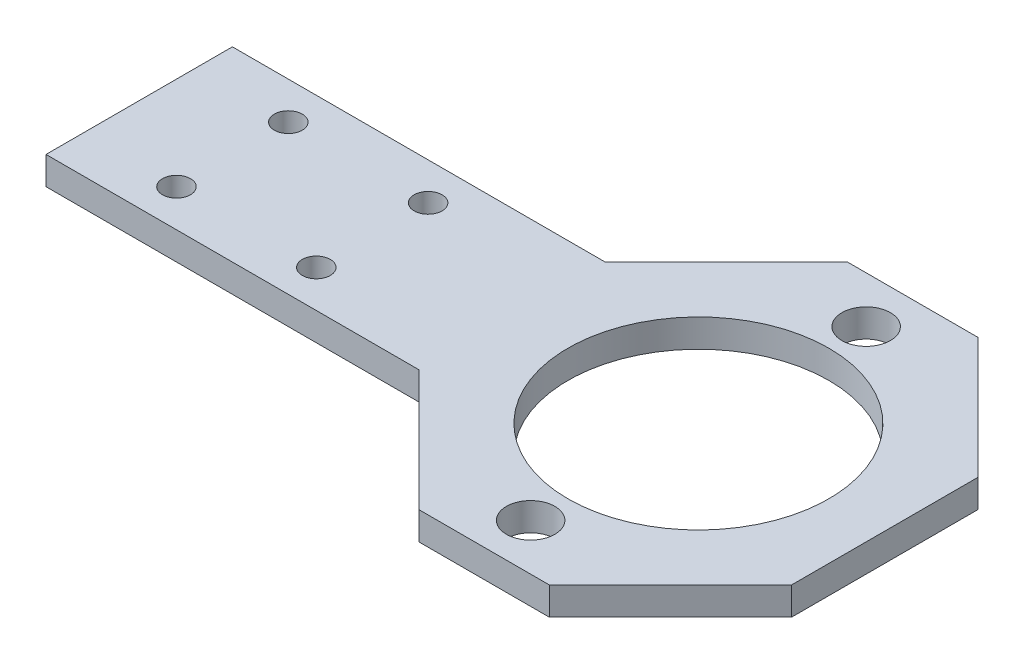
ISO-10303-21;
HEADER;
FILE_DESCRIPTION(('STEP AP214'),'2;1');
FILE_NAME('part.step','',(''),(''),'','','');
FILE_SCHEMA(('AUTOMOTIVE_DESIGN { 1 0 10303 214 1 1 1 1 }'));
ENDSEC;
DATA;
#1=APPLICATION_CONTEXT('core data for automotive mechanical design processes');
#2=APPLICATION_PROTOCOL_DEFINITION('international standard','automotive_design',2000,#1);
#3=PRODUCT_CONTEXT('',#1,'mechanical');
#4=PRODUCT('Part','Part','',(#3));
#5=PRODUCT_RELATED_PRODUCT_CATEGORY('part','',(#4));
#6=PRODUCT_DEFINITION_FORMATION('','',#4);
#7=PRODUCT_DEFINITION_CONTEXT('part definition',#1,'design');
#8=PRODUCT_DEFINITION('design','',#6,#7);
#9=PRODUCT_DEFINITION_SHAPE('','',#8);
#10=(LENGTH_UNIT() NAMED_UNIT(*) SI_UNIT(.MILLI.,.METRE.));
#11=(NAMED_UNIT(*) PLANE_ANGLE_UNIT() SI_UNIT($,.RADIAN.));
#12=(NAMED_UNIT(*) SI_UNIT($,.STERADIAN.) SOLID_ANGLE_UNIT());
#13=UNCERTAINTY_MEASURE_WITH_UNIT(LENGTH_MEASURE(1.E-05),#10,'distance_accuracy_value','');
#14=(GEOMETRIC_REPRESENTATION_CONTEXT(3) GLOBAL_UNCERTAINTY_ASSIGNED_CONTEXT((#13)) GLOBAL_UNIT_ASSIGNED_CONTEXT((#10,
#11,#12)) REPRESENTATION_CONTEXT('',''));
#15=CARTESIAN_POINT('',(0.,0.,0.));
#16=DIRECTION('',(0.,0.,1.));
#17=DIRECTION('',(1.,0.,0.));
#18=AXIS2_PLACEMENT_3D('',#15,#16,#17);
#19=CARTESIAN_POINT('',(-14.9999999999999,3.,15.));
#20=DIRECTION('',(-0.707106781186545,0.,0.70710678118655));
#21=DIRECTION('',(0.70710678118655,0.,0.707106781186545));
#22=AXIS2_PLACEMENT_3D('',#19,#20,#21);
#23=PLANE('',#22);
#24=DIRECTION('',(-0.70710678118655,0.,-0.707106781186545));
#25=VECTOR('',#24,1.);
#26=CARTESIAN_POINT('',(-14.9999999999999,0.,15.));
#27=LINE('',#26,#25);
#28=CARTESIAN_POINT('',(-6.99999999999997,0.,23.));
#29=VERTEX_POINT('',#28);
#30=CARTESIAN_POINT('',(-20.,0.,10.));
#31=VERTEX_POINT('',#30);
#32=EDGE_CURVE('E185',#29,#31,#27,.T.);
#33=ORIENTED_EDGE('',*,*,#32,.F.);
#34=DIRECTION('',(0.,-1.,0.));
#35=VECTOR('',#34,1.);
#36=CARTESIAN_POINT('',(-6.99999999999997,3.,23.));
#37=LINE('',#36,#35);
#38=CARTESIAN_POINT('',(-6.99999999999997,3.,23.));
#39=VERTEX_POINT('',#38);
#40=EDGE_CURVE('E11',#39,#29,#37,.T.);
#41=ORIENTED_EDGE('',*,*,#40,.F.);
#42=DIRECTION('',(-0.70710678118655,0.,-0.707106781186545));
#43=VECTOR('',#42,1.);
#44=CARTESIAN_POINT('',(-14.9999999999999,3.,15.));
#45=LINE('',#44,#43);
#46=CARTESIAN_POINT('',(-20.,3.,10.));
#47=VERTEX_POINT('',#46);
#48=EDGE_CURVE('E266',#39,#47,#45,.T.);
#49=ORIENTED_EDGE('',*,*,#48,.T.);
#50=DIRECTION('',(0.,-1.,0.));
#51=VECTOR('',#50,1.);
#52=CARTESIAN_POINT('',(-20.,3.,10.));
#53=LINE('',#52,#51);
#54=EDGE_CURVE('E100',#47,#31,#53,.T.);
#55=ORIENTED_EDGE('',*,*,#54,.T.);
#56=EDGE_LOOP('',(#33,#41,#49,#55));
#57=FACE_BOUND('',#56,.T.);
#58=ADVANCED_FACE('F41',(#57),#23,.T.);
#59=CARTESIAN_POINT('',(0.,3.,23.));
#60=DIRECTION('',(0.,0.,1.));
#61=DIRECTION('',(1.,0.,0.));
#62=AXIS2_PLACEMENT_3D('',#59,#60,#61);
#63=PLANE('',#62);
#64=DIRECTION('',(-1.,0.,0.));
#65=VECTOR('',#64,1.);
#66=CARTESIAN_POINT('',(0.,0.,23.));
#67=LINE('',#66,#65);
#68=CARTESIAN_POINT('',(6.99999999999994,0.,23.));
#69=VERTEX_POINT('',#68);
#70=EDGE_CURVE('E188',#69,#29,#67,.T.);
#71=ORIENTED_EDGE('',*,*,#70,.F.);
#72=DIRECTION('',(0.,-1.,0.));
#73=VECTOR('',#72,1.);
#74=CARTESIAN_POINT('',(6.99999999999994,3.,23.));
#75=LINE('',#74,#73);
#76=CARTESIAN_POINT('',(6.99999999999994,3.,23.));
#77=VERTEX_POINT('',#76);
#78=EDGE_CURVE('E51',#77,#69,#75,.T.);
#79=ORIENTED_EDGE('',*,*,#78,.F.);
#80=DIRECTION('',(-1.,0.,0.));
#81=VECTOR('',#80,1.);
#82=CARTESIAN_POINT('',(0.,3.,23.));
#83=LINE('',#82,#81);
#84=EDGE_CURVE('E259',#77,#39,#83,.T.);
#85=ORIENTED_EDGE('',*,*,#84,.T.);
#86=ORIENTED_EDGE('',*,*,#40,.T.);
#87=EDGE_LOOP('',(#71,#79,#85,#86));
#88=FACE_BOUND('',#87,.T.);
#89=ADVANCED_FACE('F248',(#88),#63,.T.);
#90=CARTESIAN_POINT('',(14.9999999999999,3.,15.0000000000001));
#91=DIRECTION('',(0.707106781186544,0.,0.707106781186551));
#92=DIRECTION('',(0.707106781186551,0.,-0.707106781186544));
#93=AXIS2_PLACEMENT_3D('',#90,#91,#92);
#94=PLANE('',#93);
#95=DIRECTION('',(-0.707106781186551,0.,0.707106781186544));
#96=VECTOR('',#95,1.);
#97=CARTESIAN_POINT('',(14.9999999999999,0.,15.0000000000001));
#98=LINE('',#97,#96);
#99=CARTESIAN_POINT('',(20.,0.,10.));
#100=VERTEX_POINT('',#99);
#101=EDGE_CURVE('E192',#100,#69,#98,.T.);
#102=ORIENTED_EDGE('',*,*,#101,.F.);
#103=DIRECTION('',(0.,-1.,0.));
#104=VECTOR('',#103,1.);
#105=CARTESIAN_POINT('',(20.,3.,10.));
#106=LINE('',#105,#104);
#107=CARTESIAN_POINT('',(20.,3.,10.));
#108=VERTEX_POINT('',#107);
#109=EDGE_CURVE('E235',#108,#100,#106,.T.);
#110=ORIENTED_EDGE('',*,*,#109,.F.);
#111=DIRECTION('',(-0.707106781186551,0.,0.707106781186544));
#112=VECTOR('',#111,1.);
#113=CARTESIAN_POINT('',(14.9999999999999,3.,15.0000000000001));
#114=LINE('',#113,#112);
#115=EDGE_CURVE('E244',#108,#77,#114,.T.);
#116=ORIENTED_EDGE('',*,*,#115,.T.);
#117=ORIENTED_EDGE('',*,*,#78,.T.);
#118=EDGE_LOOP('',(#102,#110,#116,#117));
#119=FACE_BOUND('',#118,.T.);
#120=ADVANCED_FACE('F242',(#119),#94,.T.);
#121=CARTESIAN_POINT('',(20.,3.,0.));
#122=DIRECTION('',(1.,0.,0.));
#123=DIRECTION('',(0.,0.,-1.));
#124=AXIS2_PLACEMENT_3D('',#121,#122,#123);
#125=PLANE('',#124);
#126=DIRECTION('',(0.,0.,1.));
#127=VECTOR('',#126,1.);
#128=CARTESIAN_POINT('',(20.,0.,0.));
#129=LINE('',#128,#127);
#130=CARTESIAN_POINT('',(20.,0.,-10.));
#131=VERTEX_POINT('',#130);
#132=EDGE_CURVE('E196',#131,#100,#129,.T.);
#133=ORIENTED_EDGE('',*,*,#132,.F.);
#134=DIRECTION('',(0.,-1.,0.));
#135=VECTOR('',#134,1.);
#136=CARTESIAN_POINT('',(20.,3.,-10.));
#137=LINE('',#136,#135);
#138=CARTESIAN_POINT('',(20.,3.,-10.));
#139=VERTEX_POINT('',#138);
#140=EDGE_CURVE('E232',#139,#131,#137,.T.);
#141=ORIENTED_EDGE('',*,*,#140,.F.);
#142=DIRECTION('',(0.,0.,1.));
#143=VECTOR('',#142,1.);
#144=CARTESIAN_POINT('',(20.,3.,0.));
#145=LINE('',#144,#143);
#146=EDGE_CURVE('E256',#139,#108,#145,.T.);
#147=ORIENTED_EDGE('',*,*,#146,.T.);
#148=ORIENTED_EDGE('',*,*,#109,.T.);
#149=EDGE_LOOP('',(#133,#141,#147,#148));
#150=FACE_BOUND('',#149,.T.);
#151=ADVANCED_FACE('F253',(#150),#125,.T.);
#152=CARTESIAN_POINT('',(15.,3.,-15.));
#153=DIRECTION('',(0.707106781186546,0.,-0.707106781186549));
#154=DIRECTION('',(-0.707106781186549,0.,-0.707106781186546));
#155=AXIS2_PLACEMENT_3D('',#152,#153,#154);
#156=PLANE('',#155);
#157=DIRECTION('',(0.707106781186549,0.,0.707106781186546));
#158=VECTOR('',#157,1.);
#159=CARTESIAN_POINT('',(15.,0.,-15.));
#160=LINE('',#159,#158);
#161=CARTESIAN_POINT('',(6.99999999999998,0.,-23.));
#162=VERTEX_POINT('',#161);
#163=EDGE_CURVE('E200',#162,#131,#160,.T.);
#164=ORIENTED_EDGE('',*,*,#163,.F.);
#165=DIRECTION('',(0.,-1.,0.));
#166=VECTOR('',#165,1.);
#167=CARTESIAN_POINT('',(6.99999999999998,3.,-23.));
#168=LINE('',#167,#166);
#169=CARTESIAN_POINT('',(6.99999999999998,3.,-23.));
#170=VERTEX_POINT('',#169);
#171=EDGE_CURVE('E229',#170,#162,#168,.T.);
#172=ORIENTED_EDGE('',*,*,#171,.F.);
#173=DIRECTION('',(0.707106781186549,0.,0.707106781186546));
#174=VECTOR('',#173,1.);
#175=CARTESIAN_POINT('',(15.,3.,-15.));
#176=LINE('',#175,#174);
#177=EDGE_CURVE('E264',#170,#139,#176,.T.);
#178=ORIENTED_EDGE('',*,*,#177,.T.);
#179=ORIENTED_EDGE('',*,*,#140,.T.);
#180=EDGE_LOOP('',(#164,#172,#178,#179));
#181=FACE_BOUND('',#180,.T.);
#182=ADVANCED_FACE('F286',(#181),#156,.T.);
#183=CARTESIAN_POINT('',(0.,3.,-23.));
#184=DIRECTION('',(0.,0.,-1.));
#185=DIRECTION('',(-1.,0.,0.));
#186=AXIS2_PLACEMENT_3D('',#183,#184,#185);
#187=PLANE('',#186);
#188=DIRECTION('',(1.,0.,0.));
#189=VECTOR('',#188,1.);
#190=CARTESIAN_POINT('',(0.,0.,-23.));
#191=LINE('',#190,#189);
#192=CARTESIAN_POINT('',(-7.00000000000001,0.,-23.));
#193=VERTEX_POINT('',#192);
#194=EDGE_CURVE('E204',#193,#162,#191,.T.);
#195=ORIENTED_EDGE('',*,*,#194,.F.);
#196=DIRECTION('',(0.,-1.,0.));
#197=VECTOR('',#196,1.);
#198=CARTESIAN_POINT('',(-7.00000000000001,3.,-23.));
#199=LINE('',#198,#197);
#200=CARTESIAN_POINT('',(-7.00000000000001,3.,-23.));
#201=VERTEX_POINT('',#200);
#202=EDGE_CURVE('E226',#201,#193,#199,.T.);
#203=ORIENTED_EDGE('',*,*,#202,.F.);
#204=DIRECTION('',(1.,0.,0.));
#205=VECTOR('',#204,1.);
#206=CARTESIAN_POINT('',(0.,3.,-23.));
#207=LINE('',#206,#205);
#208=EDGE_CURVE('E151',#201,#170,#207,.T.);
#209=ORIENTED_EDGE('',*,*,#208,.T.);
#210=ORIENTED_EDGE('',*,*,#171,.T.);
#211=EDGE_LOOP('',(#195,#203,#209,#210));
#212=FACE_BOUND('',#211,.T.);
#213=ADVANCED_FACE('F275',(#212),#187,.T.);
#214=CARTESIAN_POINT('',(-15.,3.,-15.));
#215=DIRECTION('',(-0.707106781186548,0.,-0.707106781186547));
#216=DIRECTION('',(-0.707106781186547,0.,0.707106781186548));
#217=AXIS2_PLACEMENT_3D('',#214,#215,#216);
#218=PLANE('',#217);
#219=DIRECTION('',(0.707106781186547,0.,-0.707106781186548));
#220=VECTOR('',#219,1.);
#221=CARTESIAN_POINT('',(-15.,0.,-15.));
#222=LINE('',#221,#220);
#223=CARTESIAN_POINT('',(-20.,0.,-10.));
#224=VERTEX_POINT('',#223);
#225=EDGE_CURVE('E208',#224,#193,#222,.T.);
#226=ORIENTED_EDGE('',*,*,#225,.F.);
#227=DIRECTION('',(0.,-1.,0.));
#228=VECTOR('',#227,1.);
#229=CARTESIAN_POINT('',(-20.,3.,-10.));
#230=LINE('',#229,#228);
#231=CARTESIAN_POINT('',(-20.,3.,-10.));
#232=VERTEX_POINT('',#231);
#233=EDGE_CURVE('E135',#232,#224,#230,.T.);
#234=ORIENTED_EDGE('',*,*,#233,.F.);
#235=DIRECTION('',(0.707106781186547,0.,-0.707106781186548));
#236=VECTOR('',#235,1.);
#237=CARTESIAN_POINT('',(-15.,3.,-15.));
#238=LINE('',#237,#236);
#239=EDGE_CURVE('E147',#232,#201,#238,.T.);
#240=ORIENTED_EDGE('',*,*,#239,.T.);
#241=ORIENTED_EDGE('',*,*,#202,.T.);
#242=EDGE_LOOP('',(#226,#234,#240,#241));
#243=FACE_BOUND('',#242,.T.);
#244=ADVANCED_FACE('F278',(#243),#218,.T.);
#245=CARTESIAN_POINT('',(0.,3.,-10.));
#246=DIRECTION('',(0.,0.,-1.));
#247=DIRECTION('',(-1.,0.,0.));
#248=AXIS2_PLACEMENT_3D('',#245,#246,#247);
#249=PLANE('',#248);
#250=DIRECTION('',(1.,0.,0.));
#251=VECTOR('',#250,1.);
#252=CARTESIAN_POINT('',(0.,0.,-10.));
#253=LINE('',#252,#251);
#254=CARTESIAN_POINT('',(-60.,0.,-10.));
#255=VERTEX_POINT('',#254);
#256=EDGE_CURVE('E131',#255,#224,#253,.T.);
#257=ORIENTED_EDGE('',*,*,#256,.F.);
#258=DIRECTION('',(0.,-1.,0.));
#259=VECTOR('',#258,1.);
#260=CARTESIAN_POINT('',(-60.,3.,-10.));
#261=LINE('',#260,#259);
#262=CARTESIAN_POINT('',(-60.,3.,-10.));
#263=VERTEX_POINT('',#262);
#264=EDGE_CURVE('E125',#263,#255,#261,.T.);
#265=ORIENTED_EDGE('',*,*,#264,.F.);
#266=DIRECTION('',(1.,0.,0.));
#267=VECTOR('',#266,1.);
#268=CARTESIAN_POINT('',(0.,3.,-10.));
#269=LINE('',#268,#267);
#270=EDGE_CURVE('E129',#263,#232,#269,.T.);
#271=ORIENTED_EDGE('',*,*,#270,.T.);
#272=ORIENTED_EDGE('',*,*,#233,.T.);
#273=EDGE_LOOP('',(#257,#265,#271,#272));
#274=FACE_BOUND('',#273,.T.);
#275=ADVANCED_FACE('F127',(#274),#249,.T.);
#276=CARTESIAN_POINT('',(-60.,3.,0.));
#277=DIRECTION('',(1.,0.,0.));
#278=DIRECTION('',(0.,0.,-1.));
#279=AXIS2_PLACEMENT_3D('',#276,#277,#278);
#280=PLANE('',#279);
#281=DIRECTION('',(0.,0.,1.));
#282=VECTOR('',#281,1.);
#283=CARTESIAN_POINT('',(-60.,0.,0.));
#284=LINE('',#283,#282);
#285=CARTESIAN_POINT('',(-60.,0.,10.));
#286=VERTEX_POINT('',#285);
#287=EDGE_CURVE('E214',#255,#286,#284,.T.);
#288=ORIENTED_EDGE('',*,*,#287,.T.);
#289=DIRECTION('',(0.,-1.,0.));
#290=VECTOR('',#289,1.);
#291=CARTESIAN_POINT('',(-60.,3.,10.));
#292=LINE('',#291,#290);
#293=CARTESIAN_POINT('',(-60.,3.,10.));
#294=VERTEX_POINT('',#293);
#295=EDGE_CURVE('E136',#294,#286,#292,.T.);
#296=ORIENTED_EDGE('',*,*,#295,.F.);
#297=DIRECTION('',(0.,0.,1.));
#298=VECTOR('',#297,1.);
#299=CARTESIAN_POINT('',(-60.,3.,0.));
#300=LINE('',#299,#298);
#301=EDGE_CURVE('E139',#263,#294,#300,.T.);
#302=ORIENTED_EDGE('',*,*,#301,.F.);
#303=ORIENTED_EDGE('',*,*,#264,.T.);
#304=EDGE_LOOP('',(#288,#296,#302,#303));
#305=FACE_BOUND('',#304,.T.);
#306=ADVANCED_FACE('F140',(#305),#280,.F.);
#307=CARTESIAN_POINT('',(-35.,3.,-6.));
#308=DIRECTION('',(0.,-1.,0.));
#309=DIRECTION('',(0.,0.,-1.));
#310=AXIS2_PLACEMENT_3D('',#307,#308,#309);
#311=CYLINDRICAL_SURFACE('',#310,1.5);
#312=CARTESIAN_POINT('',(-35.,3.,-6.));
#313=DIRECTION('',(0.,1.,0.));
#314=DIRECTION('',(0.,0.,1.));
#315=AXIS2_PLACEMENT_3D('',#312,#313,#314);
#316=CIRCLE('',#315,1.5);
#317=CARTESIAN_POINT('',(-35.,3.,-4.5));
#318=VERTEX_POINT('',#317);
#319=EDGE_CURVE('E470',#318,#318,#316,.T.);
#320=ORIENTED_EDGE('',*,*,#319,.T.);
#321=EDGE_LOOP('',(#320));
#322=FACE_BOUND('',#321,.T.);
#323=CARTESIAN_POINT('',(-35.,0.,-6.));
#324=DIRECTION('',(0.,1.,0.));
#325=DIRECTION('',(0.,0.,1.));
#326=AXIS2_PLACEMENT_3D('',#323,#324,#325);
#327=CIRCLE('',#326,1.5);
#328=CARTESIAN_POINT('',(-35.,0.,-4.5));
#329=VERTEX_POINT('',#328);
#330=EDGE_CURVE('E181',#329,#329,#327,.T.);
#331=ORIENTED_EDGE('',*,*,#330,.F.);
#332=EDGE_LOOP('',(#331));
#333=FACE_BOUND('',#332,.T.);
#334=ADVANCED_FACE('F296',(#322,#333),#311,.F.);
#335=CARTESIAN_POINT('',(-50.,3.,-6.));
#336=DIRECTION('',(0.,-1.,0.));
#337=DIRECTION('',(0.,0.,-1.));
#338=AXIS2_PLACEMENT_3D('',#335,#336,#337);
#339=CYLINDRICAL_SURFACE('',#338,1.5);
#340=CARTESIAN_POINT('',(-50.,3.,-6.));
#341=DIRECTION('',(0.,1.,0.));
#342=DIRECTION('',(0.,0.,1.));
#343=AXIS2_PLACEMENT_3D('',#340,#341,#342);
#344=CIRCLE('',#343,1.5);
#345=CARTESIAN_POINT('',(-50.,3.,-4.5));
#346=VERTEX_POINT('',#345);
#347=EDGE_CURVE('E473',#346,#346,#344,.T.);
#348=ORIENTED_EDGE('',*,*,#347,.T.);
#349=EDGE_LOOP('',(#348));
#350=FACE_BOUND('',#349,.T.);
#351=CARTESIAN_POINT('',(-50.,0.,-6.));
#352=DIRECTION('',(0.,1.,0.));
#353=DIRECTION('',(0.,0.,1.));
#354=AXIS2_PLACEMENT_3D('',#351,#352,#353);
#355=CIRCLE('',#354,1.5);
#356=CARTESIAN_POINT('',(-50.,0.,-4.5));
#357=VERTEX_POINT('',#356);
#358=EDGE_CURVE('E177',#357,#357,#355,.T.);
#359=ORIENTED_EDGE('',*,*,#358,.F.);
#360=EDGE_LOOP('',(#359));
#361=FACE_BOUND('',#360,.T.);
#362=ADVANCED_FACE('F299',(#350,#361),#339,.F.);
#363=CARTESIAN_POINT('',(-35.,3.,6.));
#364=DIRECTION('',(0.,-1.,0.));
#365=DIRECTION('',(0.,0.,-1.));
#366=AXIS2_PLACEMENT_3D('',#363,#364,#365);
#367=CYLINDRICAL_SURFACE('',#366,1.5);
#368=CARTESIAN_POINT('',(-35.,3.,6.));
#369=DIRECTION('',(0.,1.,0.));
#370=DIRECTION('',(0.,0.,1.));
#371=AXIS2_PLACEMENT_3D('',#368,#369,#370);
#372=CIRCLE('',#371,1.5);
#373=CARTESIAN_POINT('',(-35.,3.,7.5));
#374=VERTEX_POINT('',#373);
#375=EDGE_CURVE('E479',#374,#374,#372,.T.);
#376=ORIENTED_EDGE('',*,*,#375,.T.);
#377=EDGE_LOOP('',(#376));
#378=FACE_BOUND('',#377,.T.);
#379=CARTESIAN_POINT('',(-35.,0.,6.));
#380=DIRECTION('',(0.,1.,0.));
#381=DIRECTION('',(0.,0.,1.));
#382=AXIS2_PLACEMENT_3D('',#379,#380,#381);
#383=CIRCLE('',#382,1.5);
#384=CARTESIAN_POINT('',(-35.,0.,7.5));
#385=VERTEX_POINT('',#384);
#386=EDGE_CURVE('E173',#385,#385,#383,.T.);
#387=ORIENTED_EDGE('',*,*,#386,.F.);
#388=EDGE_LOOP('',(#387));
#389=FACE_BOUND('',#388,.T.);
#390=ADVANCED_FACE('F303',(#378,#389),#367,.F.);
#391=CARTESIAN_POINT('',(-50.,3.,6.));
#392=DIRECTION('',(0.,-1.,0.));
#393=DIRECTION('',(0.,0.,-1.));
#394=AXIS2_PLACEMENT_3D('',#391,#392,#393);
#395=CYLINDRICAL_SURFACE('',#394,1.5);
#396=CARTESIAN_POINT('',(-50.,3.,6.));
#397=DIRECTION('',(0.,1.,0.));
#398=DIRECTION('',(0.,0.,1.));
#399=AXIS2_PLACEMENT_3D('',#396,#397,#398);
#400=CIRCLE('',#399,1.5);
#401=CARTESIAN_POINT('',(-50.,3.,7.5));
#402=VERTEX_POINT('',#401);
#403=EDGE_CURVE('E483',#402,#402,#400,.T.);
#404=ORIENTED_EDGE('',*,*,#403,.T.);
#405=EDGE_LOOP('',(#404));
#406=FACE_BOUND('',#405,.T.);
#407=CARTESIAN_POINT('',(-50.,0.,6.));
#408=DIRECTION('',(0.,1.,0.));
#409=DIRECTION('',(0.,0.,1.));
#410=AXIS2_PLACEMENT_3D('',#407,#408,#409);
#411=CIRCLE('',#410,1.5);
#412=CARTESIAN_POINT('',(-50.,0.,7.5));
#413=VERTEX_POINT('',#412);
#414=EDGE_CURVE('E169',#413,#413,#411,.T.);
#415=ORIENTED_EDGE('',*,*,#414,.F.);
#416=EDGE_LOOP('',(#415));
#417=FACE_BOUND('',#416,.T.);
#418=ADVANCED_FACE('F307',(#406,#417),#395,.F.);
#419=CARTESIAN_POINT('',(0.,3.,0.));
#420=DIRECTION('',(0.,-1.,0.));
#421=DIRECTION('',(0.,0.,-1.));
#422=AXIS2_PLACEMENT_3D('',#419,#420,#421);
#423=CYLINDRICAL_SURFACE('',#422,14.);
#424=CARTESIAN_POINT('',(0.,3.,0.));
#425=DIRECTION('',(0.,1.,0.));
#426=DIRECTION('',(0.,0.,1.));
#427=AXIS2_PLACEMENT_3D('',#424,#425,#426);
#428=CIRCLE('',#427,14.);
#429=CARTESIAN_POINT('',(0.,3.,14.));
#430=VERTEX_POINT('',#429);
#431=EDGE_CURVE('E487',#430,#430,#428,.T.);
#432=ORIENTED_EDGE('',*,*,#431,.T.);
#433=EDGE_LOOP('',(#432));
#434=FACE_BOUND('',#433,.T.);
#435=CARTESIAN_POINT('',(0.,0.,0.));
#436=DIRECTION('',(0.,1.,0.));
#437=DIRECTION('',(0.,0.,1.));
#438=AXIS2_PLACEMENT_3D('',#435,#436,#437);
#439=CIRCLE('',#438,14.);
#440=CARTESIAN_POINT('',(0.,0.,14.));
#441=VERTEX_POINT('',#440);
#442=EDGE_CURVE('E165',#441,#441,#439,.T.);
#443=ORIENTED_EDGE('',*,*,#442,.F.);
#444=EDGE_LOOP('',(#443));
#445=FACE_BOUND('',#444,.T.);
#446=ADVANCED_FACE('F311',(#434,#445),#423,.F.);
#447=CARTESIAN_POINT('',(0.,3.,-18.));
#448=DIRECTION('',(0.,-1.,0.));
#449=DIRECTION('',(0.,0.,-1.));
#450=AXIS2_PLACEMENT_3D('',#447,#448,#449);
#451=CYLINDRICAL_SURFACE('',#450,2.6);
#452=CARTESIAN_POINT('',(0.,3.,-18.));
#453=DIRECTION('',(0.,1.,0.));
#454=DIRECTION('',(0.,0.,1.));
#455=AXIS2_PLACEMENT_3D('',#452,#453,#454);
#456=CIRCLE('',#455,2.6);
#457=CARTESIAN_POINT('',(0.,3.,-15.4));
#458=VERTEX_POINT('',#457);
#459=EDGE_CURVE('E326',#458,#458,#456,.T.);
#460=ORIENTED_EDGE('',*,*,#459,.T.);
#461=EDGE_LOOP('',(#460));
#462=FACE_BOUND('',#461,.T.);
#463=CARTESIAN_POINT('',(0.,0.,-18.));
#464=DIRECTION('',(0.,1.,0.));
#465=DIRECTION('',(0.,0.,1.));
#466=AXIS2_PLACEMENT_3D('',#463,#464,#465);
#467=CIRCLE('',#466,2.6);
#468=CARTESIAN_POINT('',(0.,0.,-15.4));
#469=VERTEX_POINT('',#468);
#470=EDGE_CURVE('E161',#469,#469,#467,.T.);
#471=ORIENTED_EDGE('',*,*,#470,.F.);
#472=EDGE_LOOP('',(#471));
#473=FACE_BOUND('',#472,.T.);
#474=ADVANCED_FACE('F314',(#462,#473),#451,.F.);
#475=CARTESIAN_POINT('',(0.,3.,18.));
#476=DIRECTION('',(0.,-1.,0.));
#477=DIRECTION('',(0.,0.,-1.));
#478=AXIS2_PLACEMENT_3D('',#475,#476,#477);
#479=CYLINDRICAL_SURFACE('',#478,2.6);
#480=CARTESIAN_POINT('',(0.,3.,18.));
#481=DIRECTION('',(0.,1.,0.));
#482=DIRECTION('',(0.,0.,1.));
#483=AXIS2_PLACEMENT_3D('',#480,#481,#482);
#484=CIRCLE('',#483,2.6);
#485=CARTESIAN_POINT('',(0.,3.,20.6));
#486=VERTEX_POINT('',#485);
#487=EDGE_CURVE('E219',#486,#486,#484,.T.);
#488=ORIENTED_EDGE('',*,*,#487,.T.);
#489=EDGE_LOOP('',(#488));
#490=FACE_BOUND('',#489,.T.);
#491=CARTESIAN_POINT('',(0.,0.,18.));
#492=DIRECTION('',(0.,1.,0.));
#493=DIRECTION('',(0.,0.,1.));
#494=AXIS2_PLACEMENT_3D('',#491,#492,#493);
#495=CIRCLE('',#494,2.6);
#496=CARTESIAN_POINT('',(0.,0.,20.6));
#497=VERTEX_POINT('',#496);
#498=EDGE_CURVE('E157',#497,#497,#495,.T.);
#499=ORIENTED_EDGE('',*,*,#498,.F.);
#500=EDGE_LOOP('',(#499));
#501=FACE_BOUND('',#500,.T.);
#502=ADVANCED_FACE('F43',(#490,#501),#479,.F.);
#503=CARTESIAN_POINT('',(0.,3.,10.));
#504=DIRECTION('',(0.,0.,-1.));
#505=DIRECTION('',(-1.,0.,0.));
#506=AXIS2_PLACEMENT_3D('',#503,#504,#505);
#507=PLANE('',#506);
#508=DIRECTION('',(1.,0.,0.));
#509=VECTOR('',#508,1.);
#510=CARTESIAN_POINT('',(0.,0.,10.));
#511=LINE('',#510,#509);
#512=EDGE_CURVE('E93',#286,#31,#511,.T.);
#513=ORIENTED_EDGE('',*,*,#512,.T.);
#514=ORIENTED_EDGE('',*,*,#54,.F.);
#515=DIRECTION('',(1.,0.,0.));
#516=VECTOR('',#515,1.);
#517=CARTESIAN_POINT('',(0.,3.,10.));
#518=LINE('',#517,#516);
#519=EDGE_CURVE('E59',#294,#47,#518,.T.);
#520=ORIENTED_EDGE('',*,*,#519,.F.);
#521=ORIENTED_EDGE('',*,*,#295,.T.);
#522=EDGE_LOOP('',(#513,#514,#520,#521));
#523=FACE_BOUND('',#522,.T.);
#524=ADVANCED_FACE('F321',(#523),#507,.F.);
#525=CARTESIAN_POINT('',(0.,3.,0.));
#526=DIRECTION('',(0.,1.,0.));
#527=DIRECTION('',(0.,0.,1.));
#528=AXIS2_PLACEMENT_3D('',#525,#526,#527);
#529=PLANE('',#528);
#530=ORIENTED_EDGE('',*,*,#487,.F.);
#531=EDGE_LOOP('',(#530));
#532=FACE_BOUND('',#531,.T.);
#533=ORIENTED_EDGE('',*,*,#459,.F.);
#534=EDGE_LOOP('',(#533));
#535=FACE_BOUND('',#534,.T.);
#536=ORIENTED_EDGE('',*,*,#431,.F.);
#537=EDGE_LOOP('',(#536));
#538=FACE_BOUND('',#537,.T.);
#539=ORIENTED_EDGE('',*,*,#403,.F.);
#540=EDGE_LOOP('',(#539));
#541=FACE_BOUND('',#540,.T.);
#542=ORIENTED_EDGE('',*,*,#375,.F.);
#543=EDGE_LOOP('',(#542));
#544=FACE_BOUND('',#543,.T.);
#545=ORIENTED_EDGE('',*,*,#347,.F.);
#546=EDGE_LOOP('',(#545));
#547=FACE_BOUND('',#546,.T.);
#548=ORIENTED_EDGE('',*,*,#319,.F.);
#549=EDGE_LOOP('',(#548));
#550=FACE_BOUND('',#549,.T.);
#551=ORIENTED_EDGE('',*,*,#48,.F.);
#552=ORIENTED_EDGE('',*,*,#84,.F.);
#553=ORIENTED_EDGE('',*,*,#115,.F.);
#554=ORIENTED_EDGE('',*,*,#146,.F.);
#555=ORIENTED_EDGE('',*,*,#177,.F.);
#556=ORIENTED_EDGE('',*,*,#208,.F.);
#557=ORIENTED_EDGE('',*,*,#239,.F.);
#558=ORIENTED_EDGE('',*,*,#270,.F.);
#559=ORIENTED_EDGE('',*,*,#301,.T.);
#560=ORIENTED_EDGE('',*,*,#519,.T.);
#561=EDGE_LOOP('',(#551,#552,#553,#554,#555,#556,#557,#558,#559,#560));
#562=FACE_BOUND('',#561,.T.);
#563=ADVANCED_FACE('F144',(#532,#535,#538,#541,#544,#547,#550,#562),#529,.T.);
#564=CARTESIAN_POINT('',(0.,0.,0.));
#565=DIRECTION('',(0.,1.,0.));
#566=DIRECTION('',(0.,0.,1.));
#567=AXIS2_PLACEMENT_3D('',#564,#565,#566);
#568=PLANE('',#567);
#569=ORIENTED_EDGE('',*,*,#498,.T.);
#570=EDGE_LOOP('',(#569));
#571=FACE_BOUND('',#570,.T.);
#572=ORIENTED_EDGE('',*,*,#470,.T.);
#573=EDGE_LOOP('',(#572));
#574=FACE_BOUND('',#573,.T.);
#575=ORIENTED_EDGE('',*,*,#442,.T.);
#576=EDGE_LOOP('',(#575));
#577=FACE_BOUND('',#576,.T.);
#578=ORIENTED_EDGE('',*,*,#414,.T.);
#579=EDGE_LOOP('',(#578));
#580=FACE_BOUND('',#579,.T.);
#581=ORIENTED_EDGE('',*,*,#386,.T.);
#582=EDGE_LOOP('',(#581));
#583=FACE_BOUND('',#582,.T.);
#584=ORIENTED_EDGE('',*,*,#358,.T.);
#585=EDGE_LOOP('',(#584));
#586=FACE_BOUND('',#585,.T.);
#587=ORIENTED_EDGE('',*,*,#330,.T.);
#588=EDGE_LOOP('',(#587));
#589=FACE_BOUND('',#588,.T.);
#590=ORIENTED_EDGE('',*,*,#32,.T.);
#591=ORIENTED_EDGE('',*,*,#512,.F.);
#592=ORIENTED_EDGE('',*,*,#287,.F.);
#593=ORIENTED_EDGE('',*,*,#256,.T.);
#594=ORIENTED_EDGE('',*,*,#225,.T.);
#595=ORIENTED_EDGE('',*,*,#194,.T.);
#596=ORIENTED_EDGE('',*,*,#163,.T.);
#597=ORIENTED_EDGE('',*,*,#132,.T.);
#598=ORIENTED_EDGE('',*,*,#101,.T.);
#599=ORIENTED_EDGE('',*,*,#70,.T.);
#600=EDGE_LOOP('',(#590,#591,#592,#593,#594,#595,#596,#597,#598,#599));
#601=FACE_BOUND('',#600,.T.);
#602=ADVANCED_FACE('F249',(#571,#574,#577,#580,#583,#586,#589,#601),#568,.F.);
#603=CLOSED_SHELL('',(#58,#89,#120,#151,#182,#213,#244,#275,#306,#334,#362,#390,#418,#446,#474,
#502,#524,#563,#602));
#604=MANIFOLD_SOLID_BREP('B2',#603);
#605=ADVANCED_BREP_SHAPE_REPRESENTATION('',(#18,#604),#14);
#606=SHAPE_DEFINITION_REPRESENTATION(#9,#605);
ENDSEC;
END-ISO-10303-21;
